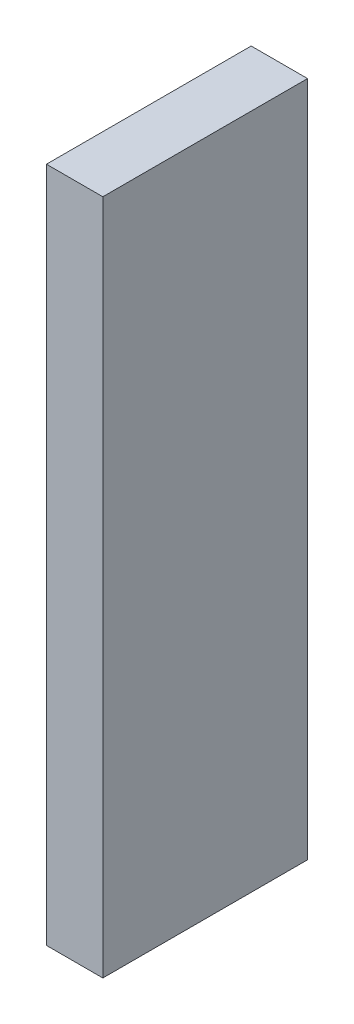
ISO-10303-21;
HEADER;
FILE_DESCRIPTION(('STEP AP214'),'2;1');
FILE_NAME('part.step','',(''),(''),'','','');
FILE_SCHEMA(('AUTOMOTIVE_DESIGN { 1 0 10303 214 1 1 1 1 }'));
ENDSEC;
DATA;
#1=APPLICATION_CONTEXT('core data for automotive mechanical design processes');
#2=APPLICATION_PROTOCOL_DEFINITION('international standard','automotive_design',2000,#1);
#3=PRODUCT_CONTEXT('',#1,'mechanical');
#4=PRODUCT('Part','Part','',(#3));
#5=PRODUCT_RELATED_PRODUCT_CATEGORY('part','',(#4));
#6=PRODUCT_DEFINITION_FORMATION('','',#4);
#7=PRODUCT_DEFINITION_CONTEXT('part definition',#1,'design');
#8=PRODUCT_DEFINITION('design','',#6,#7);
#9=PRODUCT_DEFINITION_SHAPE('','',#8);
#10=(LENGTH_UNIT() NAMED_UNIT(*) SI_UNIT(.MILLI.,.METRE.));
#11=(NAMED_UNIT(*) PLANE_ANGLE_UNIT() SI_UNIT($,.RADIAN.));
#12=(NAMED_UNIT(*) SI_UNIT($,.STERADIAN.) SOLID_ANGLE_UNIT());
#13=UNCERTAINTY_MEASURE_WITH_UNIT(LENGTH_MEASURE(1.E-05),#10,'distance_accuracy_value','');
#14=(GEOMETRIC_REPRESENTATION_CONTEXT(3) GLOBAL_UNCERTAINTY_ASSIGNED_CONTEXT((#13)) GLOBAL_UNIT_ASSIGNED_CONTEXT((#10,
#11,#12)) REPRESENTATION_CONTEXT('',''));
#15=CARTESIAN_POINT('',(0.,0.,0.));
#16=DIRECTION('',(0.,0.,1.));
#17=DIRECTION('',(1.,0.,0.));
#18=AXIS2_PLACEMENT_3D('',#15,#16,#17);
#19=CARTESIAN_POINT('',(673.5,923.215693174257,7.25595560908232));
#20=DIRECTION('',(0.,0.,1.));
#21=DIRECTION('',(1.,0.,0.));
#22=AXIS2_PLACEMENT_3D('',#19,#20,#21);
#23=PLANE('',#22);
#24=DIRECTION('',(0.,-1.,0.));
#25=VECTOR('',#24,1.);
#26=CARTESIAN_POINT('',(675.,923.215693174257,7.25595560908232));
#27=LINE('',#26,#25);
#28=CARTESIAN_POINT('',(675.,923.215693174257,7.25595560908232));
#29=VERTEX_POINT('',#28);
#30=CARTESIAN_POINT('',(675.,905.217388123702,7.25595560908232));
#31=VERTEX_POINT('',#30);
#32=EDGE_CURVE('E98',#29,#31,#27,.T.);
#33=ORIENTED_EDGE('',*,*,#32,.F.);
#34=DIRECTION('',(1.,0.,0.));
#35=VECTOR('',#34,1.);
#36=CARTESIAN_POINT('',(673.5,923.215693174257,7.25595560908232));
#37=LINE('',#36,#35);
#38=CARTESIAN_POINT('',(673.5,923.215693174257,7.25595560908232));
#39=VERTEX_POINT('',#38);
#40=EDGE_CURVE('E11',#39,#29,#37,.T.);
#41=ORIENTED_EDGE('',*,*,#40,.F.);
#42=DIRECTION('',(0.,-1.,0.));
#43=VECTOR('',#42,1.);
#44=CARTESIAN_POINT('',(673.5,923.215693174257,7.25595560908232));
#45=LINE('',#44,#43);
#46=CARTESIAN_POINT('',(673.5,905.217388123702,7.25595560908232));
#47=VERTEX_POINT('',#46);
#48=EDGE_CURVE('E92',#39,#47,#45,.T.);
#49=ORIENTED_EDGE('',*,*,#48,.T.);
#50=DIRECTION('',(1.,0.,0.));
#51=VECTOR('',#50,1.);
#52=CARTESIAN_POINT('',(673.5,905.217388123702,7.25595560908232));
#53=LINE('',#52,#51);
#54=EDGE_CURVE('E37',#47,#31,#53,.T.);
#55=ORIENTED_EDGE('',*,*,#54,.T.);
#56=EDGE_LOOP('',(#33,#41,#49,#55));
#57=FACE_BOUND('',#56,.T.);
#58=ADVANCED_FACE('F34',(#57),#23,.T.);
#59=CARTESIAN_POINT('',(673.5,923.215693174257,7.25595560908232));
#60=DIRECTION('',(0.,1.,0.));
#61=DIRECTION('',(0.,0.,1.));
#62=AXIS2_PLACEMENT_3D('',#59,#60,#61);
#63=PLANE('',#62);
#64=DIRECTION('',(0.,0.,1.));
#65=VECTOR('',#64,1.);
#66=CARTESIAN_POINT('',(675.,923.215693174257,7.25595560908232));
#67=LINE('',#66,#65);
#68=CARTESIAN_POINT('',(675.,923.215693174257,1.8098704670706));
#69=VERTEX_POINT('',#68);
#70=EDGE_CURVE('E94',#69,#29,#67,.T.);
#71=ORIENTED_EDGE('',*,*,#70,.F.);
#72=DIRECTION('',(1.,0.,0.));
#73=VECTOR('',#72,1.);
#74=CARTESIAN_POINT('',(673.5,923.215693174257,1.8098704670706));
#75=LINE('',#74,#73);
#76=CARTESIAN_POINT('',(673.5,923.215693174257,1.8098704670706));
#77=VERTEX_POINT('',#76);
#78=EDGE_CURVE('E43',#77,#69,#75,.T.);
#79=ORIENTED_EDGE('',*,*,#78,.F.);
#80=DIRECTION('',(0.,0.,1.));
#81=VECTOR('',#80,1.);
#82=CARTESIAN_POINT('',(673.5,923.215693174257,7.25595560908232));
#83=LINE('',#82,#81);
#84=EDGE_CURVE('E89',#77,#39,#83,.T.);
#85=ORIENTED_EDGE('',*,*,#84,.T.);
#86=ORIENTED_EDGE('',*,*,#40,.T.);
#87=EDGE_LOOP('',(#71,#79,#85,#86));
#88=FACE_BOUND('',#87,.T.);
#89=ADVANCED_FACE('F108',(#88),#63,.T.);
#90=CARTESIAN_POINT('',(673.5,923.215693174257,1.8098704670706));
#91=DIRECTION('',(0.,0.,-1.));
#92=DIRECTION('',(-1.,0.,0.));
#93=AXIS2_PLACEMENT_3D('',#90,#91,#92);
#94=PLANE('',#93);
#95=DIRECTION('',(0.,1.,0.));
#96=VECTOR('',#95,1.);
#97=CARTESIAN_POINT('',(675.,923.215693174257,1.8098704670706));
#98=LINE('',#97,#96);
#99=CARTESIAN_POINT('',(675.,905.217388123702,1.8098704670706));
#100=VERTEX_POINT('',#99);
#101=EDGE_CURVE('E84',#100,#69,#98,.T.);
#102=ORIENTED_EDGE('',*,*,#101,.F.);
#103=DIRECTION('',(1.,0.,0.));
#104=VECTOR('',#103,1.);
#105=CARTESIAN_POINT('',(673.5,905.217388123702,1.8098704670706));
#106=LINE('',#105,#104);
#107=CARTESIAN_POINT('',(673.5,905.217388123702,1.8098704670706));
#108=VERTEX_POINT('',#107);
#109=EDGE_CURVE('E79',#108,#100,#106,.T.);
#110=ORIENTED_EDGE('',*,*,#109,.F.);
#111=DIRECTION('',(0.,1.,0.));
#112=VECTOR('',#111,1.);
#113=CARTESIAN_POINT('',(673.5,923.215693174257,1.8098704670706));
#114=LINE('',#113,#112);
#115=EDGE_CURVE('E82',#108,#77,#114,.T.);
#116=ORIENTED_EDGE('',*,*,#115,.T.);
#117=ORIENTED_EDGE('',*,*,#78,.T.);
#118=EDGE_LOOP('',(#102,#110,#116,#117));
#119=FACE_BOUND('',#118,.T.);
#120=ADVANCED_FACE('F81',(#119),#94,.T.);
#121=CARTESIAN_POINT('',(673.5,905.217388123702,7.25595560908232));
#122=DIRECTION('',(0.,-1.,0.));
#123=DIRECTION('',(0.,0.,-1.));
#124=AXIS2_PLACEMENT_3D('',#121,#122,#123);
#125=PLANE('',#124);
#126=DIRECTION('',(0.,0.,-1.));
#127=VECTOR('',#126,1.);
#128=CARTESIAN_POINT('',(675.,905.217388123702,7.25595560908232));
#129=LINE('',#128,#127);
#130=EDGE_CURVE('E101',#31,#100,#129,.T.);
#131=ORIENTED_EDGE('',*,*,#130,.F.);
#132=ORIENTED_EDGE('',*,*,#54,.F.);
#133=DIRECTION('',(0.,0.,-1.));
#134=VECTOR('',#133,1.);
#135=CARTESIAN_POINT('',(673.5,905.217388123702,7.25595560908232));
#136=LINE('',#135,#134);
#137=EDGE_CURVE('E88',#47,#108,#136,.T.);
#138=ORIENTED_EDGE('',*,*,#137,.T.);
#139=ORIENTED_EDGE('',*,*,#109,.T.);
#140=EDGE_LOOP('',(#131,#132,#138,#139));
#141=FACE_BOUND('',#140,.T.);
#142=ADVANCED_FACE('F91',(#141),#125,.T.);
#143=CARTESIAN_POINT('',(673.5,0.,0.));
#144=DIRECTION('',(1.,0.,0.));
#145=DIRECTION('',(0.,0.,-1.));
#146=AXIS2_PLACEMENT_3D('',#143,#144,#145);
#147=PLANE('',#146);
#148=ORIENTED_EDGE('',*,*,#48,.F.);
#149=ORIENTED_EDGE('',*,*,#84,.F.);
#150=ORIENTED_EDGE('',*,*,#115,.F.);
#151=ORIENTED_EDGE('',*,*,#137,.F.);
#152=EDGE_LOOP('',(#148,#149,#150,#151));
#153=FACE_BOUND('',#152,.T.);
#154=ADVANCED_FACE('F87',(#153),#147,.F.);
#155=CARTESIAN_POINT('',(675.,0.,0.));
#156=DIRECTION('',(1.,0.,0.));
#157=DIRECTION('',(0.,0.,-1.));
#158=AXIS2_PLACEMENT_3D('',#155,#156,#157);
#159=PLANE('',#158);
#160=ORIENTED_EDGE('',*,*,#32,.T.);
#161=ORIENTED_EDGE('',*,*,#130,.T.);
#162=ORIENTED_EDGE('',*,*,#101,.T.);
#163=ORIENTED_EDGE('',*,*,#70,.T.);
#164=EDGE_LOOP('',(#160,#161,#162,#163));
#165=FACE_BOUND('',#164,.T.);
#166=ADVANCED_FACE('F107',(#165),#159,.T.);
#167=CLOSED_SHELL('',(#58,#89,#120,#142,#154,#166));
#168=MANIFOLD_SOLID_BREP('B2',#167);
#169=ADVANCED_BREP_SHAPE_REPRESENTATION('',(#18,#168),#14);
#170=SHAPE_DEFINITION_REPRESENTATION(#9,#169);
ENDSEC;
END-ISO-10303-21;
